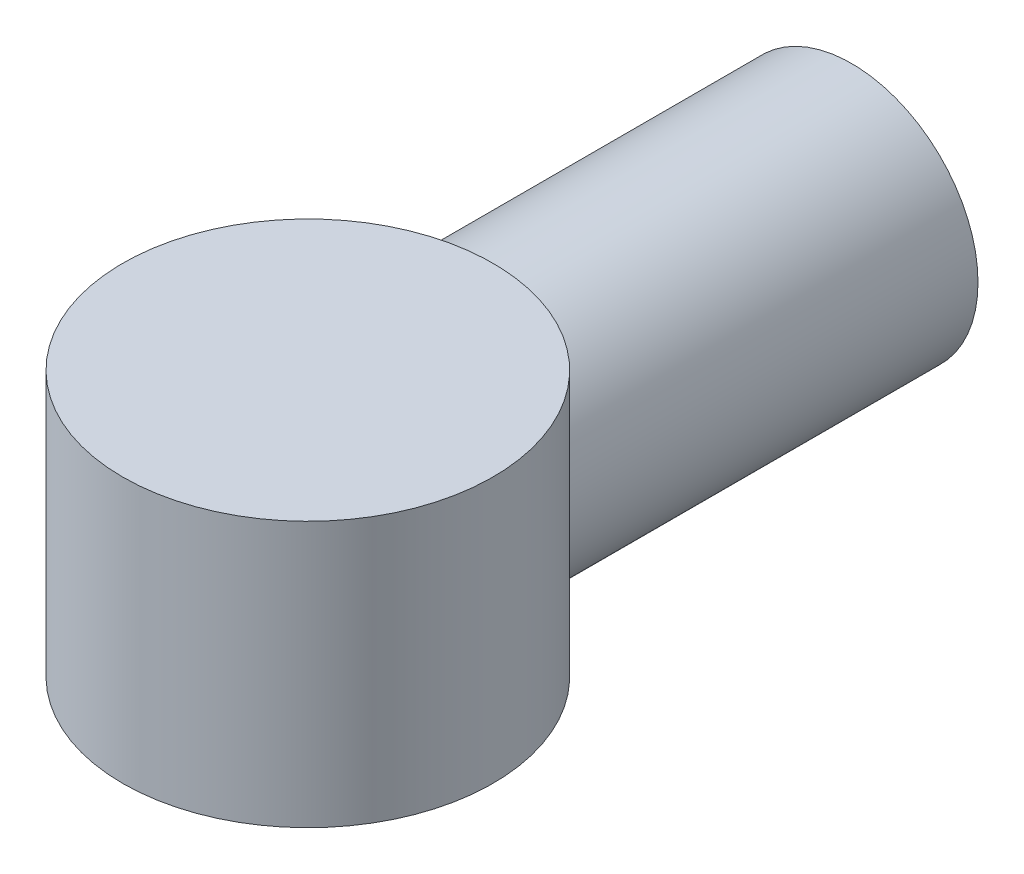
ISO-10303-21;
HEADER;
FILE_DESCRIPTION(('STEP AP214'),'2;1');
FILE_NAME('part.step','',(''),(''),'','','');
FILE_SCHEMA(('AUTOMOTIVE_DESIGN { 1 0 10303 214 1 1 1 1 }'));
ENDSEC;
DATA;
#1=APPLICATION_CONTEXT('core data for automotive mechanical design processes');
#2=APPLICATION_PROTOCOL_DEFINITION('international standard','automotive_design',2000,#1);
#3=PRODUCT_CONTEXT('',#1,'mechanical');
#4=PRODUCT('Part','Part','',(#3));
#5=PRODUCT_RELATED_PRODUCT_CATEGORY('part','',(#4));
#6=PRODUCT_DEFINITION_FORMATION('','',#4);
#7=PRODUCT_DEFINITION_CONTEXT('part definition',#1,'design');
#8=PRODUCT_DEFINITION('design','',#6,#7);
#9=PRODUCT_DEFINITION_SHAPE('','',#8);
#10=(LENGTH_UNIT() NAMED_UNIT(*) SI_UNIT(.MILLI.,.METRE.));
#11=(NAMED_UNIT(*) PLANE_ANGLE_UNIT() SI_UNIT($,.RADIAN.));
#12=(NAMED_UNIT(*) SI_UNIT($,.STERADIAN.) SOLID_ANGLE_UNIT());
#13=UNCERTAINTY_MEASURE_WITH_UNIT(LENGTH_MEASURE(1.E-05),#10,'distance_accuracy_value','');
#14=(GEOMETRIC_REPRESENTATION_CONTEXT(3) GLOBAL_UNCERTAINTY_ASSIGNED_CONTEXT((#13)) GLOBAL_UNIT_ASSIGNED_CONTEXT((#10,
#11,#12)) REPRESENTATION_CONTEXT('',''));
#15=CARTESIAN_POINT('',(0.,0.,0.));
#16=DIRECTION('',(0.,0.,1.));
#17=DIRECTION('',(1.,0.,0.));
#18=AXIS2_PLACEMENT_3D('',#15,#16,#17);
#19=CARTESIAN_POINT('',(0.,25.,102.473472637417));
#20=DIRECTION('',(0.,-1.,0.));
#21=DIRECTION('',(0.,0.,-1.));
#22=AXIS2_PLACEMENT_3D('',#19,#20,#21);
#23=CYLINDRICAL_SURFACE('',#22,34.8869608064512);
#24=CARTESIAN_POINT('',(0.,25.,102.473472637417));
#25=DIRECTION('',(0.,1.,0.));
#26=DIRECTION('',(0.,0.,1.));
#27=AXIS2_PLACEMENT_3D('',#24,#25,#26);
#28=CIRCLE('',#27,34.8869608064512);
#29=CARTESIAN_POINT('',(0.,25.,137.360433443868));
#30=VERTEX_POINT('',#29);
#31=EDGE_CURVE('E90',#30,#30,#28,.T.);
#32=ORIENTED_EDGE('',*,*,#31,.F.);
#33=EDGE_LOOP('',(#32));
#34=FACE_BOUND('',#33,.T.);
#35=CARTESIAN_POINT('',(0.,-25.,102.473472637417));
#36=DIRECTION('',(0.,1.,0.));
#37=DIRECTION('',(0.,0.,1.));
#38=AXIS2_PLACEMENT_3D('',#35,#36,#37);
#39=CIRCLE('',#38,34.8869608064512);
#40=CARTESIAN_POINT('',(0.,-25.,137.360433443868));
#41=VERTEX_POINT('',#40);
#42=EDGE_CURVE('E59',#41,#41,#39,.T.);
#43=ORIENTED_EDGE('',*,*,#42,.T.);
#44=EDGE_LOOP('',(#43));
#45=FACE_BOUND('',#44,.T.);
#46=CARTESIAN_POINT('',(-23.8,0.,76.9654340160164));
#47=CARTESIAN_POINT('',(-23.7999934232789,-0.576418801419144,76.9654224864551));
#48=CARTESIAN_POINT('',(-23.7790111165442,-1.1529411964045,76.9458005797443));
#49=CARTESIAN_POINT('',(-23.6955530417179,-2.30042789828507,76.8683186910635));
#50=CARTESIAN_POINT('',(-23.6330666952308,-2.8713907505308,76.8104489606488));
#51=CARTESIAN_POINT('',(-23.4678171923389,-4.00369020930131,76.6592501365312));
#52=CARTESIAN_POINT('',(-23.3649815951806,-4.56500759637919,76.5658572758954));
#53=CARTESIAN_POINT('',(-23.1209751010125,-5.67295265167801,76.3478681553006));
#54=CARTESIAN_POINT('',(-22.9798041055056,-6.21958028215185,76.2232718151688));
#55=CARTESIAN_POINT('',(-22.6629692548293,-7.28957490482201,75.9492726224235));
#56=CARTESIAN_POINT('',(-22.4876875019501,-7.81312723235293,75.8001471695467));
#57=CARTESIAN_POINT('',(-22.1036800383326,-8.84129983418151,75.4810727479273));
#58=CARTESIAN_POINT('',(-21.8949485950122,-9.34591684503167,75.3111202110321));
#59=CARTESIAN_POINT('',(-21.4458738152125,-10.3348634444718,74.9551772068326));
#60=CARTESIAN_POINT('',(-21.2055349141294,-10.8191958669979,74.7691889910343));
#61=CARTESIAN_POINT('',(-20.6947030232115,-11.7668631252132,74.3855507525045));
#62=CARTESIAN_POINT('',(-20.42420796103,-12.2301965147568,74.1878999287525));
#63=CARTESIAN_POINT('',(-19.8073785273959,-13.2096775066613,73.751827716536));
#64=CARTESIAN_POINT('',(-19.4558878071528,-13.7219785126137,73.5120472272838));
#65=CARTESIAN_POINT('',(-18.7151454002358,-14.7162391510908,73.0279433148781));
#66=CARTESIAN_POINT('',(-18.3258909859813,-15.1981965878206,72.7836195646077));
#67=CARTESIAN_POINT('',(-17.5103725108963,-16.1310584132851,72.2954515535117));
#68=CARTESIAN_POINT('',(-17.084068950002,-16.5819287170611,72.0516080950594));
#69=CARTESIAN_POINT('',(-16.1958736215276,-17.450488511825,71.5696039212662));
#70=CARTESIAN_POINT('',(-15.7339795742253,-17.8681758738179,71.3314435712343));
#71=CARTESIAN_POINT('',(-14.7014037081394,-18.7304137333746,70.8294017930397));
#72=CARTESIAN_POINT('',(-14.1249532477419,-19.16910365332,70.5672504429124));
#73=CARTESIAN_POINT('',(-12.9280824386725,-19.9958457298979,70.0638072343948));
#74=CARTESIAN_POINT('',(-12.3076545774704,-20.3838892024214,69.8225189556852));
#75=CARTESIAN_POINT('',(-11.026616307814,-21.1043236405197,69.3679670011689));
#76=CARTESIAN_POINT('',(-10.366068847461,-21.4367988673429,69.1546610018885));
#77=CARTESIAN_POINT('',(-9.34817424997351,-21.8904026671497,68.8604302193373));
#78=CARTESIAN_POINT('',(-9.00439806679816,-22.0340741495979,68.7666490848259));
#79=CARTESIAN_POINT('',(-8.30827765558709,-22.3058769027705,68.5883484701637));
#80=CARTESIAN_POINT('',(-7.95593131729409,-22.4340042985538,68.5038312999048));
#81=CARTESIAN_POINT('',(-7.07131721274117,-22.7320750284092,68.3063915983178));
#82=CARTESIAN_POINT('',(-6.53438113875734,-22.8923067623107,68.1994778877456));
#83=CARTESIAN_POINT('',(-5.44663349796937,-23.1752011828725,68.0098835953698));
#84=CARTESIAN_POINT('',(-4.89582475680757,-23.297871454294,67.9271981213197));
#85=CARTESIAN_POINT('',(-3.78400179446113,-23.5040581134994,67.7878126969488));
#86=CARTESIAN_POINT('',(-3.2229940030479,-23.5875983376159,67.7310969274806));
#87=CARTESIAN_POINT('',(-2.09434462225598,-23.7144725466885,67.6448339290833));
#88=CARTESIAN_POINT('',(-1.5267028130228,-23.7578051952988,67.6152876031628));
#89=CARTESIAN_POINT('',(-0.388011994390582,-23.8036694258833,67.5840125116054));
#90=CARTESIAN_POINT('',(0.183041219845814,-23.8061300284291,67.5823321386954));
#91=CARTESIAN_POINT('',(1.32323603275077,-23.7700313219602,67.6069521512566));
#92=CARTESIAN_POINT('',(1.89237763851074,-23.7314721652837,67.633252432814));
#93=CARTESIAN_POINT('',(3.02464219352566,-23.6138857493737,67.7132398737084));
#94=CARTESIAN_POINT('',(3.58776365336006,-23.5348487018522,67.7669336572789));
#95=CARTESIAN_POINT('',(4.70388069239944,-23.3374099811244,67.9005141360662));
#96=CARTESIAN_POINT('',(5.25687624094778,-23.2190081887604,67.9804009105696));
#97=CARTESIAN_POINT('',(6.33872572701026,-22.9470196826576,68.1628942983544));
#98=CARTESIAN_POINT('',(6.8678391539846,-22.7941498262457,68.2650367605406));
#99=CARTESIAN_POINT('',(7.91002706024392,-22.4537746582396,68.4908914563474));
#100=CARTESIAN_POINT('',(8.4231018532541,-22.2662700246185,68.614603267747));
#101=CARTESIAN_POINT('',(9.43087569518658,-21.8585017677894,68.8813551872887));
#102=CARTESIAN_POINT('',(9.92557359306053,-21.6382360968826,69.0243965035527));
#103=CARTESIAN_POINT('',(10.8946720655486,-21.166873069215,69.3273724597381));
#104=CARTESIAN_POINT('',(11.3690714309199,-20.9157738790502,69.4873081041408));
#105=CARTESIAN_POINT('',(12.3483078153223,-20.3546700619999,69.8403630774304));
#106=CARTESIAN_POINT('',(12.8505529617971,-20.0412161757087,70.0351909414737));
#107=CARTESIAN_POINT('',(13.8264830282277,-19.380804964732,70.4390012663528));
#108=CARTESIAN_POINT('',(14.3001661274048,-19.0338455077873,70.6479846277764));
#109=CARTESIAN_POINT('',(15.2182390036362,-18.3081383559605,71.0766236441966));
#110=CARTESIAN_POINT('',(15.6625987483969,-17.9293589470871,71.2962898524318));
#111=CARTESIAN_POINT('',(16.5205469468131,-17.142070068087,71.7422935444564));
#112=CARTESIAN_POINT('',(16.9341338594714,-16.7335591111305,71.9686313615457));
#113=CARTESIAN_POINT('',(17.7976142375337,-15.8160260674958,72.4629282957196));
#114=CARTESIAN_POINT('',(18.2416530524689,-15.3017504505741,72.731396727088));
#115=CARTESIAN_POINT('',(19.0849393108366,-14.2361151224849,73.2653522812956));
#116=CARTESIAN_POINT('',(19.4841777806016,-13.6847480170119,73.5308387972971));
#117=CARTESIAN_POINT('',(20.2359085468255,-12.5464308029138,74.0513535408443));
#118=CARTESIAN_POINT('',(20.5884156874895,-11.9594920803528,74.3063850715488));
#119=CARTESIAN_POINT('',(21.0802146355364,-11.0536216275783,74.6747923714575));
#120=CARTESIAN_POINT('',(21.2379741645693,-10.7474512114712,74.7952274276563));
#121=CARTESIAN_POINT('',(21.5408959020612,-10.1266541785027,75.0303207943079));
#122=CARTESIAN_POINT('',(21.6860549962364,-9.81202549614617,75.1449776737243));
#123=CARTESIAN_POINT('',(22.0363551154858,-9.00669786344431,75.4258722331339));
#124=CARTESIAN_POINT('',(22.2328176809062,-8.51054799640187,75.5874687807705));
#125=CARTESIAN_POINT('',(22.5935382672858,-7.50062973781419,75.8898781260107));
#126=CARTESIAN_POINT('',(22.7578044848251,-6.98686586969414,76.0306962111548));
#127=CARTESIAN_POINT('',(23.0521001813054,-5.94420660658114,76.2868583049628));
#128=CARTESIAN_POINT('',(23.1821805744406,-5.4153350296134,76.4022401549563));
#129=CARTESIAN_POINT('',(23.4065146859012,-4.3444535921483,76.6034535830092));
#130=CARTESIAN_POINT('',(23.5007687655733,-3.80244386422189,76.6892854591108));
#131=CARTESIAN_POINT('',(23.6524247807304,-2.70419582407584,76.8283250164302));
#132=CARTESIAN_POINT('',(23.7094986173644,-2.14787470417389,76.881242059334));
#133=CARTESIAN_POINT('',(23.7842815130469,-1.03030857033748,76.9507251154809));
#134=CARTESIAN_POINT('',(23.8019914464091,-0.469063666043406,76.9672919361006));
#135=CARTESIAN_POINT('',(23.7976527066048,0.653119380017923,76.9632440790626));
#136=CARTESIAN_POINT('',(23.7756048783285,1.21405752805064,76.9426301915303));
#137=CARTESIAN_POINT('',(23.6922414729451,2.33045411274277,76.8652527139465));
#138=CARTESIAN_POINT('',(23.630926840338,2.88591268087836,76.8084899933972));
#139=CARTESIAN_POINT('',(23.4797373200805,3.92213665353809,76.6701576689596));
#140=CARTESIAN_POINT('',(23.3940546053934,4.40402291016964,76.5922775150484));
#141=CARTESIAN_POINT('',(23.1942603637191,5.35758087067876,76.4130751229642));
#142=CARTESIAN_POINT('',(23.0801384992749,5.82924879234222,76.311744361596));
#143=CARTESIAN_POINT('',(22.8247577699404,6.76044932188342,76.0886440734891));
#144=CARTESIAN_POINT('',(22.683485643929,7.21997587422256,75.9668645625636));
#145=CARTESIAN_POINT('',(22.3751617213182,8.12532626198566,75.7060867295689));
#146=CARTESIAN_POINT('',(22.2081041883875,8.57114702183173,75.5670845774384));
#147=CARTESIAN_POINT('',(21.7676576972424,9.64804628956608,75.2084333248268));
#148=CARTESIAN_POINT('',(21.480514696295,10.2709202876238,74.9809085702822));
#149=CARTESIAN_POINT('',(20.8574299037837,11.4835837808781,74.5052525023245));
#150=CARTESIAN_POINT('',(20.5214697042056,12.0733606789931,74.2571134308379));
#151=CARTESIAN_POINT('',(19.8027323711794,13.2193008654367,73.7481172166431));
#152=CARTESIAN_POINT('',(19.4198811731219,13.775408848522,73.4872403556759));
#153=CARTESIAN_POINT('',(18.6097503941218,14.8516259763897,72.9605830442137));
#154=CARTESIAN_POINT('',(18.1824757158153,15.3717390830858,72.694803137483));
#155=CARTESIAN_POINT('',(17.2783306182021,16.381864046943,72.1611160958106));
#156=CARTESIAN_POINT('',(16.8008215639262,16.8713186838608,71.8932354167575));
#157=CARTESIAN_POINT('',(15.8029197277101,17.8094548626322,71.3658164668987));
#158=CARTESIAN_POINT('',(15.2825237796367,18.2581333890306,71.1062788139881));
#159=CARTESIAN_POINT('',(14.2011651366375,19.111267045626,70.6021321185891));
#160=CARTESIAN_POINT('',(13.6402589248925,19.5157818480859,70.3575031347296));
#161=CARTESIAN_POINT('',(12.4792953905597,20.277796559249,69.8888314807337));
#162=CARTESIAN_POINT('',(11.8792463557827,20.6353063724095,69.6647844767599));
#163=CARTESIAN_POINT('',(10.7505102967853,21.2415253225651,69.2798340154042));
#164=CARTESIAN_POINT('',(10.2275969162308,21.4983391268409,69.1147293724773));
#165=CARTESIAN_POINT('',(9.15907423957206,21.9748362980094,68.8056754965813));
#166=CARTESIAN_POINT('',(8.61346735390059,22.1945235958764,68.6617240241143));
#167=CARTESIAN_POINT('',(7.50250207252844,22.5942643938575,68.397993682423));
#168=CARTESIAN_POINT('',(6.93715282474016,22.7743359753847,68.2782037874522));
#169=CARTESIAN_POINT('',(5.7898348835558,23.092686860989,68.0653602214691));
#170=CARTESIAN_POINT('',(5.2078659924592,23.2309656676893,67.9723068686496));
#171=CARTESIAN_POINT('',(4.02839050368072,23.4643400347754,67.8147388140668));
#172=CARTESIAN_POINT('',(3.43082037668806,23.5592144289078,67.7503703175464));
#173=CARTESIAN_POINT('',(2.22766767264948,23.7032602523401,67.6524763561897));
#174=CARTESIAN_POINT('',(1.62208507651964,23.7524315727655,67.6189509648282));
#175=CARTESIAN_POINT('',(0.408117089163109,23.8042533327557,67.5836152068813));
#176=CARTESIAN_POINT('',(-0.20026775994007,23.8069124212439,67.5817989440012));
#177=CARTESIAN_POINT('',(-1.4146938105416,23.7656836728401,67.6099168754353));
#178=CARTESIAN_POINT('',(-2.02073514502577,23.7217985172506,67.6398492407868));
#179=CARTESIAN_POINT('',(-3.17511174789239,23.5937983487534,67.7268846208052));
#180=CARTESIAN_POINT('',(-3.72404606060242,23.5133418707181,67.7815146793293));
#181=CARTESIAN_POINT('',(-4.81198123834891,23.3150281410025,67.9156192224869));
#182=CARTESIAN_POINT('',(-5.35098275874637,23.1971733662602,67.9950920617452));
#183=CARTESIAN_POINT('',(-6.41586466746145,22.9255032874084,68.1772835021058));
#184=CARTESIAN_POINT('',(-6.94174347366962,22.7716836702424,68.2800048912253));
#185=CARTESIAN_POINT('',(-7.97752988333861,22.4298127928596,68.5067216358073));
#186=CARTESIAN_POINT('',(-8.48743665704361,22.2417597576436,68.6307180943606));
#187=CARTESIAN_POINT('',(-9.51318226811926,21.8234011335735,68.9042216856573));
#188=CARTESIAN_POINT('',(-10.028113813175,21.5914910926157,69.0546730400648));
#189=CARTESIAN_POINT('',(-11.0357028008993,21.0942867455731,69.3737352176746));
#190=CARTESIAN_POINT('',(-11.5283597984137,20.8289917726949,69.5423464035714));
#191=CARTESIAN_POINT('',(-12.4897842709057,20.2670999571635,69.8948370589099));
#192=CARTESIAN_POINT('',(-12.9585501726249,19.9705010570472,70.078717531762));
#193=CARTESIAN_POINT('',(-13.8709383481807,19.3479239588065,70.4587666137434));
#194=CARTESIAN_POINT('',(-14.3145576644838,19.0219423165565,70.6549366625827));
#195=CARTESIAN_POINT('',(-15.2435209437302,18.2887460018305,71.0881660727127));
#196=CARTESIAN_POINT('',(-15.7244237818005,17.8768253109132,71.3267975025266));
#197=CARTESIAN_POINT('',(-16.649970269136,17.0181400831517,71.8115824508825));
#198=CARTESIAN_POINT('',(-17.0946105434641,16.5713723106617,72.057736666642));
#199=CARTESIAN_POINT('',(-17.9474288694022,15.643771264855,72.5530203628534));
#200=CARTESIAN_POINT('',(-18.3555262701828,15.1628666469621,72.802155112344));
#201=CARTESIAN_POINT('',(-19.13298135753,14.169228331962,73.2974288529415));
#202=CARTESIAN_POINT('',(-19.5023372516065,13.6564931638661,73.5435677049689));
#203=CARTESIAN_POINT('',(-20.2481543595092,12.5287269154313,74.0596610284473));
#204=CARTESIAN_POINT('',(-20.6188113339861,11.9092429952493,74.3283300110698));
#205=CARTESIAN_POINT('',(-21.3055393683675,10.6320262303014,74.8445266967597));
#206=CARTESIAN_POINT('',(-21.6215944929223,9.97428229410221,75.0920482174004));
#207=CARTESIAN_POINT('',(-22.1942627831652,8.62492903321618,75.5541531477789));
#208=CARTESIAN_POINT('',(-22.4510835525252,7.9334486025017,75.768850677943));
#209=CARTESIAN_POINT('',(-22.7891082531988,6.8727214099843,76.0579742661914));
#210=CARTESIAN_POINT('',(-22.8938995067005,6.51530022333918,76.1488471015774));
#211=CARTESIAN_POINT('',(-23.087188312846,5.79321564804224,76.3182001152579));
#212=CARTESIAN_POINT('',(-23.1756888665667,5.42855360704308,76.3966825757304));
#213=CARTESIAN_POINT('',(-23.3450824994391,4.65012375833467,76.548165320795));
#214=CARTESIAN_POINT('',(-23.4238996599105,4.23556984102833,76.6194714340324));
#215=CARTESIAN_POINT('',(-23.5596848166813,3.40005650726203,76.7431455328398));
#216=CARTESIAN_POINT('',(-23.6166513574851,2.979096666037,76.7955122568214));
#217=CARTESIAN_POINT('',(-23.7080525563766,2.13288920553287,76.8798762181874));
#218=CARTESIAN_POINT('',(-23.7424979886499,1.70764373553374,76.9118831955544));
#219=CARTESIAN_POINT('',(-23.7884720075606,0.854950886617269,76.9546643856077));
#220=CARTESIAN_POINT('',(-23.8000048776587,0.427503934246384,76.9654425669743));
#221=CARTESIAN_POINT('',(-23.8,0.,76.9654340160164));
#222=B_SPLINE_CURVE_WITH_KNOTS('',3,(#46,#47,#48,#49,#50,#51,#52,#53,#54,#55,#56,#57,#58,#59,
#60,#61,#62,#63,#64,#65,#66,#67,#68,#69,#70,#71,#72,#73,#74,#75,#76,#77,#78,#79,#80,#81,#82,#83,
#84,#85,#86,#87,#88,#89,#90,#91,#92,#93,#94,#95,#96,#97,#98,#99,#100,#101,#102,#103,#104,#105,
#106,#107,#108,#109,#110,#111,#112,#113,#114,#115,#116,#117,#118,#119,#120,#121,#122,#123,#124,
#125,#126,#127,#128,#129,#130,#131,#132,#133,#134,#135,#136,#137,#138,#139,#140,#141,#142,#143,
#144,#145,#146,#147,#148,#149,#150,#151,#152,#153,#154,#155,#156,#157,#158,#159,#160,#161,#162,
#163,#164,#165,#166,#167,#168,#169,#170,#171,#172,#173,#174,#175,#176,#177,#178,#179,#180,#181,
#182,#183,#184,#185,#186,#187,#188,#189,#190,#191,#192,#193,#194,#195,#196,#197,#198,#199,#200,
#201,#202,#203,#204,#205,#206,#207,#208,#209,#210,#211,#212,#213,#214,#215,#216,#217,#218,#219,
#220,#221),.UNSPECIFIED.,.T.,.F.,(4,2,2,2,2,2,2,2,2,2,2,2,2,2,2,2,2,2,2,2,2,2,2,2,2,2,2,2,2,2,2,
2,2,2,2,2,2,2,2,2,2,2,2,2,2,2,2,2,2,2,2,2,2,2,2,2,2,2,2,2,2,2,2,2,2,2,2,2,2,2,2,2,2,2,2,2,2,2,2,
2,2,2,2,2,2,2,2,4),(0.,1.72873561587331,3.45791201462044,5.19020718897562,6.92250681424603,
8.63641559826065,10.3506184253807,12.0645809588391,13.7786613493665,15.7746497489281,
17.77078242141,19.7690700160479,21.7674857160884,24.0754498214858,26.3838091442289,
28.6886357751461,29.8408282201133,30.9933073042085,32.7026866286872,34.411720551357,
36.1197120461878,37.8277603060878,39.5387744962662,41.2497823321454,42.9612041162408,
44.6726310808839,46.3512994949207,48.0299350526353,49.7086755760635,51.387515968123,
53.2554894928936,55.1235819719729,56.9935589292416,58.8636294655681,61.0529367471517,
63.2426817748918,65.4317295549531,66.5260466804873,67.6206335084412,69.2917620550382,
70.9624646097958,72.6306646415606,74.2988478472994,75.9815594628825,77.6642337033026,
79.346872185717,81.0294701964863,82.5147617910072,84.0005940694729,85.487153932475,
86.9740449798215,89.1388230029146,91.3044194502115,93.4734816838119,95.6423047903223,
97.8431213642296,100.044100559641,102.242068082227,104.439571724618,106.254333536037,
108.068903078961,109.882642689503,111.696403884549,113.51930685059,115.342214159163,
117.16478249554,118.987245843817,120.657787847617,122.328219232323,123.99885104509,
125.669569504633,127.421147543777,129.172760572538,130.924488798544,132.676422622692,
134.704432983453,136.73263187515,138.765202054356,140.797866234978,143.105640215815,
145.41408657841,147.714315039283,148.863979028726,150.013431014348,151.296325122192,
152.579304670299,153.861669986048,155.143795543434),.UNSPECIFIED.);
#223=CARTESIAN_POINT('',(-23.8,0.,76.9654340160164));
#224=VERTEX_POINT('',#223);
#225=EDGE_CURVE('E10',#224,#224,#222,.T.);
#226=ORIENTED_EDGE('',*,*,#225,.T.);
#227=EDGE_LOOP('',(#226));
#228=FACE_BOUND('',#227,.T.);
#229=ADVANCED_FACE('F34',(#34,#45,#228),#23,.T.);
#230=CARTESIAN_POINT('',(0.,25.,102.473472637417));
#231=DIRECTION('',(0.,1.,0.));
#232=DIRECTION('',(0.,0.,1.));
#233=AXIS2_PLACEMENT_3D('',#230,#231,#232);
#234=PLANE('',#233);
#235=ORIENTED_EDGE('',*,*,#31,.T.);
#236=EDGE_LOOP('',(#235));
#237=FACE_BOUND('',#236,.T.);
#238=ADVANCED_FACE('F81',(#237),#234,.T.);
#239=CARTESIAN_POINT('',(0.,-25.,102.473472637417));
#240=DIRECTION('',(0.,1.,0.));
#241=DIRECTION('',(0.,0.,1.));
#242=AXIS2_PLACEMENT_3D('',#239,#240,#241);
#243=PLANE('',#242);
#244=ORIENTED_EDGE('',*,*,#42,.F.);
#245=EDGE_LOOP('',(#244));
#246=FACE_BOUND('',#245,.T.);
#247=ADVANCED_FACE('F67',(#246),#243,.F.);
#248=CARTESIAN_POINT('',(0.,0.,80.));
#249=DIRECTION('',(0.,0.,-1.));
#250=DIRECTION('',(-1.,0.,0.));
#251=AXIS2_PLACEMENT_3D('',#248,#249,#250);
#252=CYLINDRICAL_SURFACE('',#251,23.8);
#253=CARTESIAN_POINT('',(0.,0.,0.));
#254=DIRECTION('',(0.,0.,1.));
#255=DIRECTION('',(1.,0.,0.));
#256=AXIS2_PLACEMENT_3D('',#253,#254,#255);
#257=CIRCLE('',#256,23.8);
#258=CARTESIAN_POINT('',(23.8,0.,0.));
#259=VERTEX_POINT('',#258);
#260=EDGE_CURVE('E48',#259,#259,#257,.T.);
#261=ORIENTED_EDGE('',*,*,#260,.T.);
#262=EDGE_LOOP('',(#261));
#263=FACE_BOUND('',#262,.T.);
#264=ORIENTED_EDGE('',*,*,#225,.F.);
#265=EDGE_LOOP('',(#264));
#266=FACE_BOUND('',#265,.T.);
#267=ADVANCED_FACE('F36',(#263,#266),#252,.T.);
#268=CARTESIAN_POINT('',(0.,0.,80.));
#269=DIRECTION('',(0.,0.,-1.));
#270=DIRECTION('',(-1.,0.,0.));
#271=AXIS2_PLACEMENT_3D('',#268,#269,#270);
#272=CYLINDRICAL_SURFACE('',#271,19.);
#273=CARTESIAN_POINT('',(0.,0.,0.));
#274=DIRECTION('',(0.,0.,1.));
#275=DIRECTION('',(1.,0.,0.));
#276=AXIS2_PLACEMENT_3D('',#273,#274,#275);
#277=CIRCLE('',#276,19.);
#278=CARTESIAN_POINT('',(19.,0.,0.));
#279=VERTEX_POINT('',#278);
#280=EDGE_CURVE('E53',#279,#279,#277,.T.);
#281=ORIENTED_EDGE('',*,*,#280,.F.);
#282=EDGE_LOOP('',(#281));
#283=FACE_BOUND('',#282,.T.);
#284=CARTESIAN_POINT('',(-19.,0.,73.214285459526));
#285=CARTESIAN_POINT('',(-19.0000041221513,-0.488015720927359,73.2142908645628));
#286=CARTESIAN_POINT('',(-18.9811757706332,-0.97598558772951,73.2020364684778));
#287=CARTESIAN_POINT('',(-18.9061599866318,-1.94801667178813,73.1535278133211));
#288=CARTESIAN_POINT('',(-18.8499597284938,-2.43207648941135,73.1172653149338));
#289=CARTESIAN_POINT('',(-18.7009241549055,-3.39296602109567,73.0221017349277));
#290=CARTESIAN_POINT('',(-18.6080345835605,-3.86978393651353,72.9631671293326));
#291=CARTESIAN_POINT('',(-18.3869067059098,-4.81205452008513,72.8248865378558));
#292=CARTESIAN_POINT('',(-18.2586704319365,-5.27750783999552,72.7455417255191));
#293=CARTESIAN_POINT('',(-17.9692725394776,-6.19141348912797,72.5697317048933));
#294=CARTESIAN_POINT('',(-17.8083196914151,-6.63995323609034,72.4733755377545));
#295=CARTESIAN_POINT('',(-17.4545896725056,-7.52081027413803,72.2662000848708));
#296=CARTESIAN_POINT('',(-17.2618121586817,-7.9531273903292,72.1553806432569));
#297=CARTESIAN_POINT('',(-16.8459788240165,-8.79974085012178,71.9223710150822));
#298=CARTESIAN_POINT('',(-16.6229219882485,-9.21403658905323,71.8001804474182));
#299=CARTESIAN_POINT('',(-16.1479734830827,-10.0231256240607,71.5475071431366));
#300=CARTESIAN_POINT('',(-15.8960790318667,-10.4179170333856,71.4170236070796));
#301=CARTESIAN_POINT('',(-15.338437088574,-11.224798801279,71.1375663455688));
#302=CARTESIAN_POINT('',(-15.0298262930886,-11.6347220316918,70.9880422147438));
#303=CARTESIAN_POINT('',(-14.3811347292339,-12.4276006276354,70.6865116954403));
#304=CARTESIAN_POINT('',(-14.0410647579846,-12.8105651667918,70.5345061732436));
#305=CARTESIAN_POINT('',(-13.3306185245426,-13.5483224121037,70.2315144309661));
#306=CARTESIAN_POINT('',(-12.9602197851937,-13.9030938330777,70.0805290583007));
#307=CARTESIAN_POINT('',(-12.1908753074551,-14.582383442922,69.783219054087));
#308=CARTESIAN_POINT('',(-11.7919284815758,-14.9069004782187,69.6368946003955));
#309=CARTESIAN_POINT('',(-10.9325157807846,-15.5496504072302,69.3403523431259));
#310=CARTESIAN_POINT('',(-10.4696966922215,-15.8650721203434,69.1908377591636));
#311=CARTESIAN_POINT('',(-9.5148807406197,-16.4554579623894,68.9054021935031));
#312=CARTESIAN_POINT('',(-9.02288181136197,-16.7304192215146,68.7694821762685));
#313=CARTESIAN_POINT('',(-8.01298853091187,-17.2369051059809,68.5152191275413));
#314=CARTESIAN_POINT('',(-7.49510916269305,-17.4684545031152,68.3968660800191));
#315=CARTESIAN_POINT('',(-6.43688901621778,-17.8854622073848,68.1812298259264));
#316=CARTESIAN_POINT('',(-5.89655116776865,-18.0709265046321,68.0839438812787));
#317=CARTESIAN_POINT('',(-4.84282137841126,-18.3799728861128,67.9205030849909));
#318=CARTESIAN_POINT('',(-4.33084348280659,-18.5073773291344,67.8524520078998));
#319=CARTESIAN_POINT('',(-3.2956605086594,-18.7194468286592,67.7386241993393));
#320=CARTESIAN_POINT('',(-2.77245599237031,-18.8041140203523,67.6928463550841));
#321=CARTESIAN_POINT('',(-1.71960458153653,-18.9294438819067,67.6249273793005));
#322=CARTESIAN_POINT('',(-1.18996189251689,-18.9701338647356,67.6027715769234));
#323=CARTESIAN_POINT('',(-0.128686882392629,-19.0069798409946,67.582713688359));
#324=CARTESIAN_POINT('',(0.402945282251011,-19.0031392658602,67.5848097333729));
#325=CARTESIAN_POINT('',(1.40875960568508,-18.9536873472467,67.611717573998));
#326=CARTESIAN_POINT('',(1.88322591928257,-18.9124134978543,67.6341704775455));
#327=CARTESIAN_POINT('',(2.8264354202514,-18.7946029589354,67.6979830693986));
#328=CARTESIAN_POINT('',(3.29517908529451,-18.7180692335098,67.7393411684478));
#329=CARTESIAN_POINT('',(4.22377504542404,-18.5306264323281,67.8399930325523));
#330=CARTESIAN_POINT('',(4.68362703001316,-18.4197161584384,67.8992874227435));
#331=CARTESIAN_POINT('',(5.59153610015569,-18.1647207328162,68.0344623030178));
#332=CARTESIAN_POINT('',(6.03959272962247,-18.0206343003668,68.1103434334019));
#333=CARTESIAN_POINT('',(6.92622977494919,-17.6989328052828,68.2779582633988));
#334=CARTESIAN_POINT('',(7.36464985017208,-17.5209634064362,68.3698585404557));
#335=CARTESIAN_POINT('',(8.22452167384849,-17.1341622057242,68.5669561034339));
#336=CARTESIAN_POINT('',(8.64597349598088,-16.9253305378862,68.6721533316095));
#337=CARTESIAN_POINT('',(9.47008003905182,-16.4783908767576,68.8937208503312));
#338=CARTESIAN_POINT('',(9.87273098633185,-16.2402770405878,69.0100933697444));
#339=CARTESIAN_POINT('',(10.6575558513503,-15.7363913657645,69.2517151832112));
#340=CARTESIAN_POINT('',(11.039727899789,-15.4706170087705,69.3769652851891));
#341=CARTESIAN_POINT('',(11.8217438771376,-14.8832221509585,69.6476393901331));
#342=CARTESIAN_POINT('',(12.2191354286999,-14.5586685119325,69.7937913219459));
#343=CARTESIAN_POINT('',(12.985478202905,-13.8794652469296,70.0906640763849));
#344=CARTESIAN_POINT('',(13.3544276701852,-13.5248137662347,70.2413851802085));
#345=CARTESIAN_POINT('',(14.062682131967,-12.7868203585149,70.5440277916235));
#346=CARTESIAN_POINT('',(14.4019587738433,-12.4034516273112,70.6959502992739));
#347=CARTESIAN_POINT('',(15.048949372352,-11.6099614863282,70.9971876070557));
#348=CARTESIAN_POINT('',(15.3566619649636,-11.1998389216504,71.1465022942606));
#349=CARTESIAN_POINT('',(15.9637081574717,-10.3184398466432,71.4511420903126));
#350=CARTESIAN_POINT('',(16.2600964688256,-9.84492978660871,71.6058961405759));
#351=CARTESIAN_POINT('',(16.811516151579,-8.87053009777732,71.9027176469765));
#352=CARTESIAN_POINT('',(17.0665441909098,-8.36963826739056,72.0447840805593));
#353=CARTESIAN_POINT('',(17.5324814714216,-7.34364985351143,72.3108453113713));
#354=CARTESIAN_POINT('',(17.7434311872963,-6.81857602063662,72.4348566555756));
#355=CARTESIAN_POINT('',(18.1188041363545,-5.74725374258614,72.6597685737127));
#356=CARTESIAN_POINT('',(18.2832347705363,-5.20100868140818,72.7606728234037));
#357=CARTESIAN_POINT('',(18.5516767780939,-4.13662649841988,72.9276055517591));
#358=CARTESIAN_POINT('',(18.6595001426182,-3.61979094266976,72.995795212927));
#359=CARTESIAN_POINT('',(18.8319684188363,-2.57615814670319,73.105675109284));
#360=CARTESIAN_POINT('',(18.8966160639717,-2.04936153928968,73.1473670220295));
#361=CARTESIAN_POINT('',(18.9815432020858,-0.99120598103193,73.202264425153));
#362=CARTESIAN_POINT('',(19.0018637618811,-0.45985171130706,73.2154962821832));
#363=CARTESIAN_POINT('',(18.9978681586472,0.602589175741591,73.2129005553855));
#364=CARTESIAN_POINT('',(18.9735566097777,1.13367581505588,73.1970759754721));
#365=CARTESIAN_POINT('',(18.8873485908731,2.11554469945233,73.1414048648017));
#366=CARTESIAN_POINT('',(18.8312521624273,2.56706432595124,73.1052710811291));
#367=CARTESIAN_POINT('',(18.6872659001313,3.46292758106421,73.0134416889224));
#368=CARTESIAN_POINT('',(18.5993797313258,3.90727203073908,72.9577483354362));
#369=CARTESIAN_POINT('',(18.392821339931,4.78623473893466,72.8285918282179));
#370=CARTESIAN_POINT('',(18.2741387132879,5.22084965649539,72.7551226698038));
#371=CARTESIAN_POINT('',(18.0072297692263,6.07792465935343,72.5926410814204));
#372=CARTESIAN_POINT('',(17.8590014329547,6.50038391179773,72.5036275893611));
#373=CARTESIAN_POINT('',(17.527387458782,7.34894255730938,72.3084386132641));
#374=CARTESIAN_POINT('',(17.3427725626234,7.77442955925006,72.2016933300945));
#375=CARTESIAN_POINT('',(16.9442381665762,8.60851569843845,71.9768306019355));
#376=CARTESIAN_POINT('',(16.7303065530915,9.01710776341681,71.8587084620836));
#377=CARTESIAN_POINT('',(16.2745368177715,9.81585042377884,71.614010901119));
#378=CARTESIAN_POINT('',(16.0326939414212,10.2059978612287,71.4874340413472));
#379=CARTESIAN_POINT('',(15.5223934190201,10.9665424133945,71.2286780483093));
#380=CARTESIAN_POINT('',(15.2539334493417,11.3369377994411,71.0964984265092));
#381=CARTESIAN_POINT('',(14.648004832381,12.1125629391581,70.8085834889328));
#382=CARTESIAN_POINT('',(14.306287457298,12.5143053029282,70.6523700367601));
#383=CARTESIAN_POINT('',(13.5905958218942,13.2880958123344,70.340184923151));
#384=CARTESIAN_POINT('',(13.2166186936629,13.6601413122298,70.1842132844693));
#385=CARTESIAN_POINT('',(12.4378546896102,14.3728391837311,69.8763071181443));
#386=CARTESIAN_POINT('',(12.0330500372508,14.7134731879163,69.7243749890339));
#387=CARTESIAN_POINT('',(11.1946295519635,15.3610160164467,69.4283833225942));
#388=CARTESIAN_POINT('',(10.7610153603118,15.6679267593634,69.2843233376403));
#389=CARTESIAN_POINT('',(9.84559127705882,16.2596225455175,69.0010258476068));
#390=CARTESIAN_POINT('',(9.36246860880591,16.5426505563966,68.8623473542755));
#391=CARTESIAN_POINT('',(8.36954373856005,17.0665109640874,68.6014453908181));
#392=CARTESIAN_POINT('',(7.85974016292739,17.3073411856074,68.4792227690657));
#393=CARTESIAN_POINT('',(6.8173395013114,17.7438119024727,68.2549416649183));
#394=CARTESIAN_POINT('',(6.28476168036607,17.9394897303276,68.1528665345224));
#395=CARTESIAN_POINT('',(5.20063567021121,18.2832330792159,67.9719472345707));
#396=CARTESIAN_POINT('',(4.64909024979773,18.431305517065,67.8930996903068));
#397=CARTESIAN_POINT('',(3.5883870817823,18.6651537013783,67.7678635714267));
#398=CARTESIAN_POINT('',(3.08057113742455,18.7557093508492,67.719001769108));
#399=CARTESIAN_POINT('',(2.05763111128657,18.8953049470539,67.6434695556583));
#400=CARTESIAN_POINT('',(1.54250753155305,18.9443477318805,67.6167976274834));
#401=CARTESIAN_POINT('',(0.509520042259061,19.0002063290109,67.5864072819604));
#402=CARTESIAN_POINT('',(-0.00834261741101646,19.0070399754255,67.5826791704445));
#403=CARTESIAN_POINT('',(-1.04253730955072,18.9784263424,67.598258703743));
#404=CARTESIAN_POINT('',(-1.558869412979,18.9429810548023,67.6175652633494));
#405=CARTESIAN_POINT('',(-2.54098817614918,18.8352291016292,67.6760005189247));
#406=CARTESIAN_POINT('',(-3.00727215476739,18.7663888981135,67.7132632787839));
#407=CARTESIAN_POINT('',(-3.9316949103352,18.5946969543155,67.8056554266839));
#408=CARTESIAN_POINT('',(-4.38983428186168,18.4918477076125,67.8607835048147));
#409=CARTESIAN_POINT('',(-5.29511188781587,18.2532447228263,67.9876671773181));
#410=CARTESIAN_POINT('',(-5.74224946046062,18.1174890106493,68.0594237692417));
#411=CARTESIAN_POINT('',(-6.62294322922588,17.8144189507934,68.2180075492956));
#412=CARTESIAN_POINT('',(-7.0564987750413,17.6471030947051,68.3048354577401));
#413=CARTESIAN_POINT('',(-7.9228335385631,17.2759533517986,68.4950630869319));
#414=CARTESIAN_POINT('',(-8.35504419117062,17.0710381520466,68.5989399003178));
#415=CARTESIAN_POINT('',(-9.20040925098167,16.6306836799508,68.8187066095728));
#416=CARTESIAN_POINT('',(-9.61356342504425,16.3952440342986,68.9345966523581));
#417=CARTESIAN_POINT('',(-10.419175226163,15.8954571373344,69.1760596797787));
#418=CARTESIAN_POINT('',(-10.8116270486816,15.6311018418214,69.3016353560333));
#419=CARTESIAN_POINT('',(-11.574249018912,15.0751280259916,69.5599659313509));
#420=CARTESIAN_POINT('',(-11.9444168151274,14.7835066367123,69.6927215852765));
#421=CARTESIAN_POINT('',(-12.7018594250686,14.1399080731392,69.9781707294199));
#422=CARTESIAN_POINT('',(-13.0863023238281,13.784837691971,70.1314162151676));
#423=CARTESIAN_POINT('',(-13.8242551455206,13.0446590736287,70.4398967603344));
#424=CARTESIAN_POINT('',(-14.1777627255876,12.6595485655559,70.5951319694249));
#425=CARTESIAN_POINT('',(-14.8526085240391,11.8605971407426,70.9039001596945));
#426=CARTESIAN_POINT('',(-15.1739081544634,11.4467227438069,71.0574309075758));
#427=CARTESIAN_POINT('',(-15.7821307911115,10.5924163682393,71.3585317262963));
#428=CARTESIAN_POINT('',(-16.069055485797,10.1519856956234,71.5061020896672));
#429=CARTESIAN_POINT('',(-16.6234963321291,9.21804612715301,71.7999674899336));
#430=CARTESIAN_POINT('',(-16.8886800387514,8.72294022530446,71.9456068675775));
#431=CARTESIAN_POINT('',(-17.3757194012947,7.70724331013529,72.2201647735084));
#432=CARTESIAN_POINT('',(-17.5975676010862,7.18664793043668,72.3490804231));
#433=CARTESIAN_POINT('',(-17.9946604711485,6.12474958228033,72.584587670125));
#434=CARTESIAN_POINT('',(-18.170033665151,5.58350855841139,72.6912406561683));
#435=CARTESIAN_POINT('',(-18.4722458119086,4.48343511879931,72.8777331828749));
#436=CARTESIAN_POINT('',(-18.5991161204417,3.92461432168209,72.9575900423972));
#437=CARTESIAN_POINT('',(-18.7997535945545,2.80775013310399,73.084986234842));
#438=CARTESIAN_POINT('',(-18.8747120802945,2.25000441023912,73.1332490846857));
#439=CARTESIAN_POINT('',(-18.9748329492202,1.12815204827894,73.1978956044476));
#440=CARTESIAN_POINT('',(-18.9999952356443,0.564045396825525,73.2142792124196));
#441=CARTESIAN_POINT('',(-19.,0.,73.214285459526));
#442=B_SPLINE_CURVE_WITH_KNOTS('',3,(#284,#285,#286,#287,#288,#289,#290,#291,#292,#293,#294,
#295,#296,#297,#298,#299,#300,#301,#302,#303,#304,#305,#306,#307,#308,#309,#310,#311,#312,#313,
#314,#315,#316,#317,#318,#319,#320,#321,#322,#323,#324,#325,#326,#327,#328,#329,#330,#331,#332,
#333,#334,#335,#336,#337,#338,#339,#340,#341,#342,#343,#344,#345,#346,#347,#348,#349,#350,#351,
#352,#353,#354,#355,#356,#357,#358,#359,#360,#361,#362,#363,#364,#365,#366,#367,#368,#369,#370,
#371,#372,#373,#374,#375,#376,#377,#378,#379,#380,#381,#382,#383,#384,#385,#386,#387,#388,#389,
#390,#391,#392,#393,#394,#395,#396,#397,#398,#399,#400,#401,#402,#403,#404,#405,#406,#407,#408,
#409,#410,#411,#412,#413,#414,#415,#416,#417,#418,#419,#420,#421,#422,#423,#424,#425,#426,#427,
#428,#429,#430,#431,#432,#433,#434,#435,#436,#437,#438,#439,#440,#441),.UNSPECIFIED.,.T.,.F.,(4,
2,2,2,2,2,2,2,2,2,2,2,2,2,2,2,2,2,2,2,2,2,2,2,2,2,2,2,2,2,2,2,2,2,2,2,2,2,2,2,2,2,2,2,2,2,2,2,2,
2,2,2,2,2,2,2,2,2,2,2,2,2,2,2,2,2,2,2,2,2,2,2,2,2,2,2,2,2,4),(0.,1.46345759827263,
2.92741769955385,4.39355084900815,5.85959971766035,7.31657166125651,8.77355930777523,
10.2305958028461,11.6877729694493,13.2894587363089,14.8905968129367,16.4929324506273,
18.0953291590294,19.8321563337659,21.5691066400836,23.3050627662894,25.0407931358518,
26.6344648033243,28.228056841707,29.8206585765932,31.4131375896013,32.8418022799507,
34.2703468923387,35.6989412997112,37.1275908651203,38.5720947339893,40.0165923299154,
41.4613786258267,42.9062965769658,44.5050924335545,46.1039868843052,47.7043927707549,
49.3048677886363,51.0416427444105,52.778557548927,54.5138703626007,56.2489069395495,
57.8435667317662,59.4381255569861,61.0312064750751,62.6241227064379,63.9918203024597,
65.3593602666157,66.72736283349,68.0954589078,69.521869649008,70.9488715668454,72.3761169256247,
73.8034869904227,75.451884552594,77.100428809585,78.7499309964111,80.3993392917201,
82.1275310265983,83.8558118233873,85.5826584965249,87.30925415431,88.8615476470056,
90.4137350061148,91.9652664935965,93.5167248883094,94.9335224238827,96.3502161013721,
97.7669947888666,99.1838412081214,100.650743437228,102.117663607966,103.584992912089,
105.052476784017,106.686628957872,108.320904786248,109.957115788777,111.59324638931,
113.331594046877,115.070240534477,116.804027507051,118.536691731146,120.228143220054,
121.919597995705),.UNSPECIFIED.);
#443=CARTESIAN_POINT('',(-19.,0.,73.214285459526));
#444=VERTEX_POINT('',#443);
#445=EDGE_CURVE('E39',#444,#444,#442,.T.);
#446=ORIENTED_EDGE('',*,*,#445,.T.);
#447=EDGE_LOOP('',(#446));
#448=FACE_BOUND('',#447,.T.);
#449=ADVANCED_FACE('F69',(#283,#448),#272,.F.);
#450=CARTESIAN_POINT('',(0.,0.,0.));
#451=DIRECTION('',(0.,0.,1.));
#452=DIRECTION('',(1.,0.,0.));
#453=AXIS2_PLACEMENT_3D('',#450,#451,#452);
#454=PLANE('',#453);
#455=ORIENTED_EDGE('',*,*,#260,.F.);
#456=EDGE_LOOP('',(#455));
#457=FACE_BOUND('',#456,.T.);
#458=ORIENTED_EDGE('',*,*,#280,.T.);
#459=EDGE_LOOP('',(#458));
#460=FACE_BOUND('',#459,.T.);
#461=ADVANCED_FACE('F65',(#457,#460),#454,.F.);
#462=ORIENTED_EDGE('',*,*,#445,.F.);
#463=EDGE_LOOP('',(#462));
#464=FACE_BOUND('',#463,.T.);
#465=ADVANCED_FACE('F61',(#464),#23,.T.);
#466=CLOSED_SHELL('',(#229,#238,#247,#267,#449,#461,#465));
#467=MANIFOLD_SOLID_BREP('B2',#466);
#468=ADVANCED_BREP_SHAPE_REPRESENTATION('',(#18,#467),#14);
#469=SHAPE_DEFINITION_REPRESENTATION(#9,#468);
ENDSEC;
END-ISO-10303-21;
